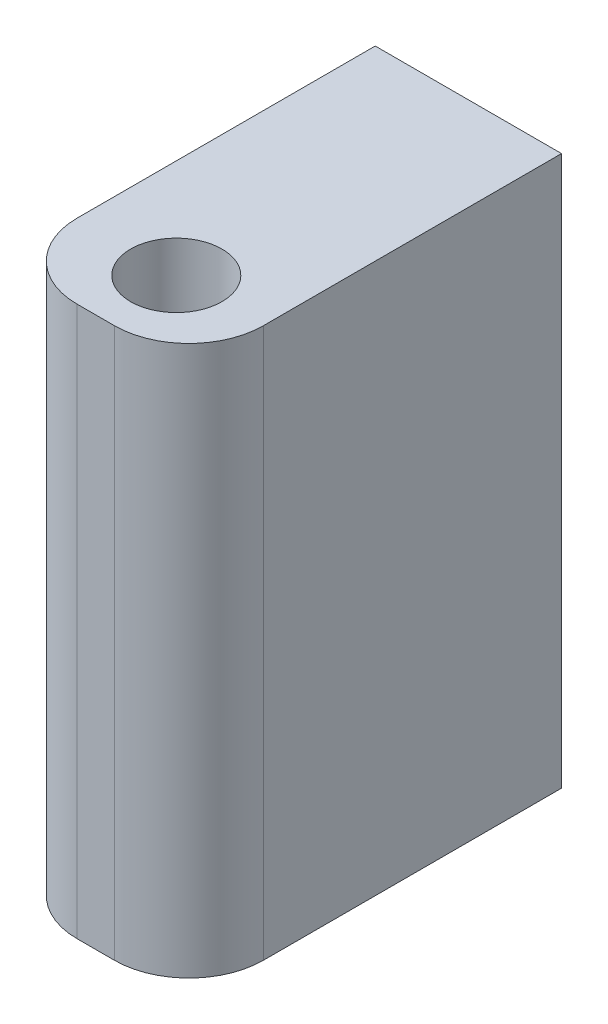
ISO-10303-21;
HEADER;
FILE_DESCRIPTION(('STEP AP214'),'2;1');
FILE_NAME('part.step','',(''),(''),'','','');
FILE_SCHEMA(('AUTOMOTIVE_DESIGN { 1 0 10303 214 1 1 1 1 }'));
ENDSEC;
DATA;
#1=APPLICATION_CONTEXT('core data for automotive mechanical design processes');
#2=APPLICATION_PROTOCOL_DEFINITION('international standard','automotive_design',2000,#1);
#3=PRODUCT_CONTEXT('',#1,'mechanical');
#4=PRODUCT('Part','Part','',(#3));
#5=PRODUCT_RELATED_PRODUCT_CATEGORY('part','',(#4));
#6=PRODUCT_DEFINITION_FORMATION('','',#4);
#7=PRODUCT_DEFINITION_CONTEXT('part definition',#1,'design');
#8=PRODUCT_DEFINITION('design','',#6,#7);
#9=PRODUCT_DEFINITION_SHAPE('','',#8);
#10=(LENGTH_UNIT() NAMED_UNIT(*) SI_UNIT(.MILLI.,.METRE.));
#11=(NAMED_UNIT(*) PLANE_ANGLE_UNIT() SI_UNIT($,.RADIAN.));
#12=(NAMED_UNIT(*) SI_UNIT($,.STERADIAN.) SOLID_ANGLE_UNIT());
#13=UNCERTAINTY_MEASURE_WITH_UNIT(LENGTH_MEASURE(1.E-05),#10,'distance_accuracy_value','');
#14=(GEOMETRIC_REPRESENTATION_CONTEXT(3) GLOBAL_UNCERTAINTY_ASSIGNED_CONTEXT((#13)) GLOBAL_UNIT_ASSIGNED_CONTEXT((#10,
#11,#12)) REPRESENTATION_CONTEXT('',''));
#15=CARTESIAN_POINT('',(0.,0.,0.));
#16=DIRECTION('',(0.,0.,1.));
#17=DIRECTION('',(1.,0.,0.));
#18=AXIS2_PLACEMENT_3D('',#15,#16,#17);
#19=CARTESIAN_POINT('',(4.67798079652414,-13.5851542825568,0.));
#20=DIRECTION('',(0.,0.,1.));
#21=DIRECTION('',(-1.,0.,0.));
#22=AXIS2_PLACEMENT_3D('',#19,#20,#21);
#23=PLANE('',#22);
#24=CARTESIAN_POINT('',(0.,7.9148457174432,0.));
#25=DIRECTION('',(0.,0.,-1.));
#26=DIRECTION('',(-1.,0.,0.));
#27=AXIS2_PLACEMENT_3D('',#24,#25,#26);
#28=CIRCLE('',#27,1.95);
#29=CARTESIAN_POINT('',(-1.95,7.9148457174432,0.));
#30=VERTEX_POINT('',#29);
#31=EDGE_CURVE('E149',#30,#30,#28,.T.);
#32=ORIENTED_EDGE('',*,*,#31,.F.);
#33=EDGE_LOOP('',(#32));
#34=FACE_BOUND('',#33,.T.);
#35=DIRECTION('',(0.,-1.,0.));
#36=VECTOR('',#35,1.);
#37=CARTESIAN_POINT('',(4.67798079652415,15.9148457174432,0.));
#38=LINE('',#37,#36);
#39=CARTESIAN_POINT('',(4.67798079652415,15.9148457174432,0.));
#40=VERTEX_POINT('',#39);
#41=CARTESIAN_POINT('',(4.67798079652414,-13.5851542825568,0.));
#42=VERTEX_POINT('',#41);
#43=EDGE_CURVE('E90',#40,#42,#38,.T.);
#44=ORIENTED_EDGE('',*,*,#43,.T.);
#45=DIRECTION('',(-1.,0.,0.));
#46=VECTOR('',#45,1.);
#47=CARTESIAN_POINT('',(4.67798079652414,-13.5851542825568,0.));
#48=LINE('',#47,#46);
#49=CARTESIAN_POINT('',(-5.32201920347586,-13.5851542825568,0.));
#50=VERTEX_POINT('',#49);
#51=EDGE_CURVE('E98',#42,#50,#48,.T.);
#52=ORIENTED_EDGE('',*,*,#51,.T.);
#53=DIRECTION('',(0.,1.,0.));
#54=VECTOR('',#53,1.);
#55=CARTESIAN_POINT('',(-5.32201920347585,15.9148457174432,0.));
#56=LINE('',#55,#54);
#57=CARTESIAN_POINT('',(-5.32201920347585,15.9148457174432,0.));
#58=VERTEX_POINT('',#57);
#59=EDGE_CURVE('E106',#50,#58,#56,.T.);
#60=ORIENTED_EDGE('',*,*,#59,.T.);
#61=DIRECTION('',(1.,0.,0.));
#62=VECTOR('',#61,1.);
#63=CARTESIAN_POINT('',(4.67798079652415,15.9148457174432,0.));
#64=LINE('',#63,#62);
#65=EDGE_CURVE('E111',#58,#40,#64,.T.);
#66=ORIENTED_EDGE('',*,*,#65,.T.);
#67=EDGE_LOOP('',(#44,#52,#60,#66));
#68=FACE_BOUND('',#67,.T.);
#69=CARTESIAN_POINT('',(0.,-7.0851542825568,0.));
#70=DIRECTION('',(0.,0.,-1.));
#71=DIRECTION('',(-1.,0.,0.));
#72=AXIS2_PLACEMENT_3D('',#69,#70,#71);
#73=CIRCLE('',#72,1.95);
#74=CARTESIAN_POINT('',(-1.95,-7.0851542825568,0.));
#75=VERTEX_POINT('',#74);
#76=EDGE_CURVE('E155',#75,#75,#73,.T.);
#77=ORIENTED_EDGE('',*,*,#76,.F.);
#78=EDGE_LOOP('',(#77));
#79=FACE_BOUND('',#78,.T.);
#80=ADVANCED_FACE('F32',(#34,#68,#79),#23,.F.);
#81=CARTESIAN_POINT('',(4.67798079652415,15.9148457174432,20.));
#82=DIRECTION('',(-1.,0.,0.));
#83=DIRECTION('',(0.,1.,0.));
#84=AXIS2_PLACEMENT_3D('',#81,#82,#83);
#85=PLANE('',#84);
#86=DIRECTION('',(0.,0.,-1.));
#87=VECTOR('',#86,1.);
#88=CARTESIAN_POINT('',(4.67798079652414,-13.5851542825568,20.));
#89=LINE('',#88,#87);
#90=CARTESIAN_POINT('',(4.67798079652414,-13.5851542825568,16.));
#91=VERTEX_POINT('',#90);
#92=EDGE_CURVE('E85',#91,#42,#89,.T.);
#93=ORIENTED_EDGE('',*,*,#92,.T.);
#94=ORIENTED_EDGE('',*,*,#43,.F.);
#95=DIRECTION('',(0.,0.,-1.));
#96=VECTOR('',#95,1.);
#97=CARTESIAN_POINT('',(4.67798079652415,15.9148457174432,20.));
#98=LINE('',#97,#96);
#99=CARTESIAN_POINT('',(4.67798079652415,15.9148457174432,16.));
#100=VERTEX_POINT('',#99);
#101=EDGE_CURVE('E124',#100,#40,#98,.T.);
#102=ORIENTED_EDGE('',*,*,#101,.F.);
#103=DIRECTION('',(0.,-1.,0.));
#104=VECTOR('',#103,1.);
#105=CARTESIAN_POINT('',(4.67798079652415,15.9148457174432,16.));
#106=LINE('',#105,#104);
#107=EDGE_CURVE('E91',#91,#100,#106,.F.);
#108=ORIENTED_EDGE('',*,*,#107,.F.);
#109=EDGE_LOOP('',(#93,#94,#102,#108));
#110=FACE_BOUND('',#109,.T.);
#111=ADVANCED_FACE('F87',(#110),#85,.F.);
#112=CARTESIAN_POINT('',(4.67798079652414,-13.5851542825568,20.));
#113=DIRECTION('',(0.,1.,0.));
#114=DIRECTION('',(0.,0.,1.));
#115=AXIS2_PLACEMENT_3D('',#112,#113,#114);
#116=PLANE('',#115);
#117=CARTESIAN_POINT('',(0.,-13.5851542825568,16.));
#118=DIRECTION('',(0.,-1.,0.));
#119=DIRECTION('',(0.,0.,1.));
#120=AXIS2_PLACEMENT_3D('',#117,#118,#119);
#121=CIRCLE('',#120,2.45);
#122=CARTESIAN_POINT('',(0.,-13.5851542825568,18.45));
#123=VERTEX_POINT('',#122);
#124=EDGE_CURVE('E112',#123,#123,#121,.T.);
#125=ORIENTED_EDGE('',*,*,#124,.F.);
#126=EDGE_LOOP('',(#125));
#127=FACE_BOUND('',#126,.T.);
#128=DIRECTION('',(-1.,0.,0.));
#129=VECTOR('',#128,1.);
#130=CARTESIAN_POINT('',(4.67798079652414,-13.5851542825568,20.));
#131=LINE('',#130,#129);
#132=CARTESIAN_POINT('',(0.677980796524142,-13.5851542825568,20.));
#133=VERTEX_POINT('',#132);
#134=CARTESIAN_POINT('',(-1.32201920347586,-13.5851542825568,20.));
#135=VERTEX_POINT('',#134);
#136=EDGE_CURVE('E123',#133,#135,#131,.T.);
#137=ORIENTED_EDGE('',*,*,#136,.T.);
#138=CARTESIAN_POINT('',(-1.32201920347586,-13.5851542825568,16.));
#139=DIRECTION('',(0.,-1.,0.));
#140=DIRECTION('',(0.,0.,1.));
#141=AXIS2_PLACEMENT_3D('',#138,#139,#140);
#142=CIRCLE('',#141,4.);
#143=CARTESIAN_POINT('',(-5.32201920347586,-13.5851542825568,16.));
#144=VERTEX_POINT('',#143);
#145=EDGE_CURVE('E132',#144,#135,#142,.F.);
#146=ORIENTED_EDGE('',*,*,#145,.F.);
#147=DIRECTION('',(0.,0.,-1.));
#148=VECTOR('',#147,1.);
#149=CARTESIAN_POINT('',(-5.32201920347586,-13.5851542825568,20.));
#150=LINE('',#149,#148);
#151=EDGE_CURVE('E95',#144,#50,#150,.T.);
#152=ORIENTED_EDGE('',*,*,#151,.T.);
#153=ORIENTED_EDGE('',*,*,#51,.F.);
#154=ORIENTED_EDGE('',*,*,#92,.F.);
#155=CARTESIAN_POINT('',(0.677980796524142,-13.5851542825568,16.));
#156=DIRECTION('',(0.,-1.,0.));
#157=DIRECTION('',(0.,0.,1.));
#158=AXIS2_PLACEMENT_3D('',#155,#156,#157);
#159=CIRCLE('',#158,4.);
#160=EDGE_CURVE('E135',#133,#91,#159,.F.);
#161=ORIENTED_EDGE('',*,*,#160,.F.);
#162=EDGE_LOOP('',(#137,#146,#152,#153,#154,#161));
#163=FACE_BOUND('',#162,.T.);
#164=ADVANCED_FACE('F100',(#127,#163),#116,.F.);
#165=CARTESIAN_POINT('',(-5.32201920347585,15.9148457174432,20.));
#166=DIRECTION('',(1.,0.,0.));
#167=DIRECTION('',(0.,-1.,0.));
#168=AXIS2_PLACEMENT_3D('',#165,#166,#167);
#169=PLANE('',#168);
#170=DIRECTION('',(0.,0.,-1.));
#171=VECTOR('',#170,1.);
#172=CARTESIAN_POINT('',(-5.32201920347585,15.9148457174432,20.));
#173=LINE('',#172,#171);
#174=CARTESIAN_POINT('',(-5.32201920347585,15.9148457174432,16.));
#175=VERTEX_POINT('',#174);
#176=EDGE_CURVE('E126',#175,#58,#173,.T.);
#177=ORIENTED_EDGE('',*,*,#176,.T.);
#178=ORIENTED_EDGE('',*,*,#59,.F.);
#179=ORIENTED_EDGE('',*,*,#151,.F.);
#180=DIRECTION('',(0.,1.,0.));
#181=VECTOR('',#180,1.);
#182=CARTESIAN_POINT('',(-5.32201920347586,-13.5851542825568,16.));
#183=LINE('',#182,#181);
#184=EDGE_CURVE('E11',#175,#144,#183,.F.);
#185=ORIENTED_EDGE('',*,*,#184,.F.);
#186=EDGE_LOOP('',(#177,#178,#179,#185));
#187=FACE_BOUND('',#186,.T.);
#188=ADVANCED_FACE('F183',(#187),#169,.F.);
#189=CARTESIAN_POINT('',(4.67798079652415,15.9148457174432,20.));
#190=DIRECTION('',(0.,-1.,0.));
#191=DIRECTION('',(0.,0.,-1.));
#192=AXIS2_PLACEMENT_3D('',#189,#190,#191);
#193=PLANE('',#192);
#194=CARTESIAN_POINT('',(0.,15.9148457174432,16.));
#195=DIRECTION('',(0.,-1.,0.));
#196=DIRECTION('',(0.,0.,1.));
#197=AXIS2_PLACEMENT_3D('',#194,#195,#196);
#198=CIRCLE('',#197,2.45);
#199=CARTESIAN_POINT('',(0.,15.9148457174432,18.45));
#200=VERTEX_POINT('',#199);
#201=EDGE_CURVE('E115',#200,#200,#198,.T.);
#202=ORIENTED_EDGE('',*,*,#201,.T.);
#203=EDGE_LOOP('',(#202));
#204=FACE_BOUND('',#203,.T.);
#205=ORIENTED_EDGE('',*,*,#101,.T.);
#206=ORIENTED_EDGE('',*,*,#65,.F.);
#207=ORIENTED_EDGE('',*,*,#176,.F.);
#208=CARTESIAN_POINT('',(-1.32201920347585,15.9148457174432,16.));
#209=DIRECTION('',(0.,1.,0.));
#210=DIRECTION('',(0.,0.,-1.));
#211=AXIS2_PLACEMENT_3D('',#208,#209,#210);
#212=CIRCLE('',#211,4.);
#213=CARTESIAN_POINT('',(-1.32201920347585,15.9148457174432,20.));
#214=VERTEX_POINT('',#213);
#215=EDGE_CURVE('E46',#214,#175,#212,.F.);
#216=ORIENTED_EDGE('',*,*,#215,.F.);
#217=DIRECTION('',(1.,0.,0.));
#218=VECTOR('',#217,1.);
#219=CARTESIAN_POINT('',(4.67798079652415,15.9148457174432,20.));
#220=LINE('',#219,#218);
#221=CARTESIAN_POINT('',(0.677980796524146,15.9148457174432,20.));
#222=VERTEX_POINT('',#221);
#223=EDGE_CURVE('E118',#214,#222,#220,.T.);
#224=ORIENTED_EDGE('',*,*,#223,.T.);
#225=CARTESIAN_POINT('',(0.677980796524146,15.9148457174432,16.));
#226=DIRECTION('',(0.,1.,0.));
#227=DIRECTION('',(0.,0.,-1.));
#228=AXIS2_PLACEMENT_3D('',#225,#226,#227);
#229=CIRCLE('',#228,4.);
#230=EDGE_CURVE('E40',#100,#222,#229,.F.);
#231=ORIENTED_EDGE('',*,*,#230,.F.);
#232=EDGE_LOOP('',(#205,#206,#207,#216,#224,#231));
#233=FACE_BOUND('',#232,.T.);
#234=ADVANCED_FACE('F141',(#204,#233),#193,.F.);
#235=CARTESIAN_POINT('',(4.67798079652414,-13.5851542825568,20.));
#236=DIRECTION('',(0.,0.,1.));
#237=DIRECTION('',(-1.,0.,0.));
#238=AXIS2_PLACEMENT_3D('',#235,#236,#237);
#239=PLANE('',#238);
#240=ORIENTED_EDGE('',*,*,#223,.F.);
#241=DIRECTION('',(0.,1.,0.));
#242=VECTOR('',#241,1.);
#243=CARTESIAN_POINT('',(-1.32201920347585,15.9148457174432,20.));
#244=LINE('',#243,#242);
#245=EDGE_CURVE('E94',#135,#214,#244,.T.);
#246=ORIENTED_EDGE('',*,*,#245,.F.);
#247=ORIENTED_EDGE('',*,*,#136,.F.);
#248=DIRECTION('',(0.,-1.,0.));
#249=VECTOR('',#248,1.);
#250=CARTESIAN_POINT('',(0.677980796524142,-13.5851542825568,20.));
#251=LINE('',#250,#249);
#252=EDGE_CURVE('E130',#222,#133,#251,.T.);
#253=ORIENTED_EDGE('',*,*,#252,.F.);
#254=EDGE_LOOP('',(#240,#246,#247,#253));
#255=FACE_BOUND('',#254,.T.);
#256=ADVANCED_FACE('F179',(#255),#239,.T.);
#257=CARTESIAN_POINT('',(0.,-13.5851542825568,16.));
#258=DIRECTION('',(0.,1.,0.));
#259=DIRECTION('',(0.,0.,1.));
#260=AXIS2_PLACEMENT_3D('',#257,#258,#259);
#261=CYLINDRICAL_SURFACE('',#260,2.45);
#262=ORIENTED_EDGE('',*,*,#124,.T.);
#263=EDGE_LOOP('',(#262));
#264=FACE_BOUND('',#263,.T.);
#265=ORIENTED_EDGE('',*,*,#201,.F.);
#266=EDGE_LOOP('',(#265));
#267=FACE_BOUND('',#266,.T.);
#268=ADVANCED_FACE('F204',(#264,#267),#261,.F.);
#269=CARTESIAN_POINT('',(0.,7.9148457174432,11.));
#270=DIRECTION('',(0.,0.,-1.));
#271=DIRECTION('',(1.,0.,0.));
#272=AXIS2_PLACEMENT_3D('',#269,#270,#271);
#273=CYLINDRICAL_SURFACE('',#272,1.95);
#274=CARTESIAN_POINT('',(0.,7.9148457174432,11.));
#275=DIRECTION('',(0.,0.,-1.));
#276=DIRECTION('',(-1.,0.,0.));
#277=AXIS2_PLACEMENT_3D('',#274,#275,#276);
#278=CIRCLE('',#277,1.95);
#279=CARTESIAN_POINT('',(-1.95,7.9148457174432,11.));
#280=VERTEX_POINT('',#279);
#281=EDGE_CURVE('E147',#280,#280,#278,.T.);
#282=ORIENTED_EDGE('',*,*,#281,.F.);
#283=EDGE_LOOP('',(#282));
#284=FACE_BOUND('',#283,.T.);
#285=ORIENTED_EDGE('',*,*,#31,.T.);
#286=EDGE_LOOP('',(#285));
#287=FACE_BOUND('',#286,.T.);
#288=ADVANCED_FACE('F201',(#284,#287),#273,.F.);
#289=CARTESIAN_POINT('',(0.,7.9148457174432,11.));
#290=DIRECTION('',(0.,0.,1.));
#291=DIRECTION('',(-1.,0.,0.));
#292=AXIS2_PLACEMENT_3D('',#289,#290,#291);
#293=PLANE('',#292);
#294=ORIENTED_EDGE('',*,*,#281,.T.);
#295=EDGE_LOOP('',(#294));
#296=FACE_BOUND('',#295,.T.);
#297=ADVANCED_FACE('F166',(#296),#293,.F.);
#298=CARTESIAN_POINT('',(0.,-7.0851542825568,11.));
#299=DIRECTION('',(0.,0.,-1.));
#300=DIRECTION('',(1.,0.,0.));
#301=AXIS2_PLACEMENT_3D('',#298,#299,#300);
#302=CYLINDRICAL_SURFACE('',#301,1.95);
#303=CARTESIAN_POINT('',(0.,-7.0851542825568,11.));
#304=DIRECTION('',(0.,0.,-1.));
#305=DIRECTION('',(-1.,0.,0.));
#306=AXIS2_PLACEMENT_3D('',#303,#304,#305);
#307=CIRCLE('',#306,1.95);
#308=CARTESIAN_POINT('',(-1.95,-7.0851542825568,11.));
#309=VERTEX_POINT('',#308);
#310=EDGE_CURVE('E152',#309,#309,#307,.T.);
#311=ORIENTED_EDGE('',*,*,#310,.F.);
#312=EDGE_LOOP('',(#311));
#313=FACE_BOUND('',#312,.T.);
#314=ORIENTED_EDGE('',*,*,#76,.T.);
#315=EDGE_LOOP('',(#314));
#316=FACE_BOUND('',#315,.T.);
#317=ADVANCED_FACE('F163',(#313,#316),#302,.F.);
#318=CARTESIAN_POINT('',(0.,-7.0851542825568,11.));
#319=DIRECTION('',(0.,0.,1.));
#320=DIRECTION('',(-1.,0.,0.));
#321=AXIS2_PLACEMENT_3D('',#318,#319,#320);
#322=PLANE('',#321);
#323=ORIENTED_EDGE('',*,*,#310,.T.);
#324=EDGE_LOOP('',(#323));
#325=FACE_BOUND('',#324,.T.);
#326=ADVANCED_FACE('F161',(#325),#322,.F.);
#327=CARTESIAN_POINT('',(0.677980796524142,-13.5851542825568,16.));
#328=DIRECTION('',(0.,1.,0.));
#329=DIRECTION('',(1.,0.,0.));
#330=AXIS2_PLACEMENT_3D('',#327,#328,#329);
#331=CYLINDRICAL_SURFACE('',#330,4.);
#332=ORIENTED_EDGE('',*,*,#230,.T.);
#333=ORIENTED_EDGE('',*,*,#252,.T.);
#334=ORIENTED_EDGE('',*,*,#160,.T.);
#335=ORIENTED_EDGE('',*,*,#107,.T.);
#336=EDGE_LOOP('',(#332,#333,#334,#335));
#337=FACE_BOUND('',#336,.T.);
#338=ADVANCED_FACE('F139',(#337),#331,.T.);
#339=CARTESIAN_POINT('',(-1.32201920347586,-13.5851542825568,16.));
#340=DIRECTION('',(0.,-1.,0.));
#341=DIRECTION('',(-1.,0.,0.));
#342=AXIS2_PLACEMENT_3D('',#339,#340,#341);
#343=CYLINDRICAL_SURFACE('',#342,4.);
#344=ORIENTED_EDGE('',*,*,#145,.T.);
#345=ORIENTED_EDGE('',*,*,#245,.T.);
#346=ORIENTED_EDGE('',*,*,#215,.T.);
#347=ORIENTED_EDGE('',*,*,#184,.T.);
#348=EDGE_LOOP('',(#344,#345,#346,#347));
#349=FACE_BOUND('',#348,.T.);
#350=ADVANCED_FACE('F34',(#349),#343,.T.);
#351=CLOSED_SHELL('',(#80,#111,#164,#188,#234,#256,#268,#288,#297,#317,#326,#338,#350));
#352=MANIFOLD_SOLID_BREP('B2',#351);
#353=ADVANCED_BREP_SHAPE_REPRESENTATION('',(#18,#352),#14);
#354=SHAPE_DEFINITION_REPRESENTATION(#9,#353);
ENDSEC;
END-ISO-10303-21;
